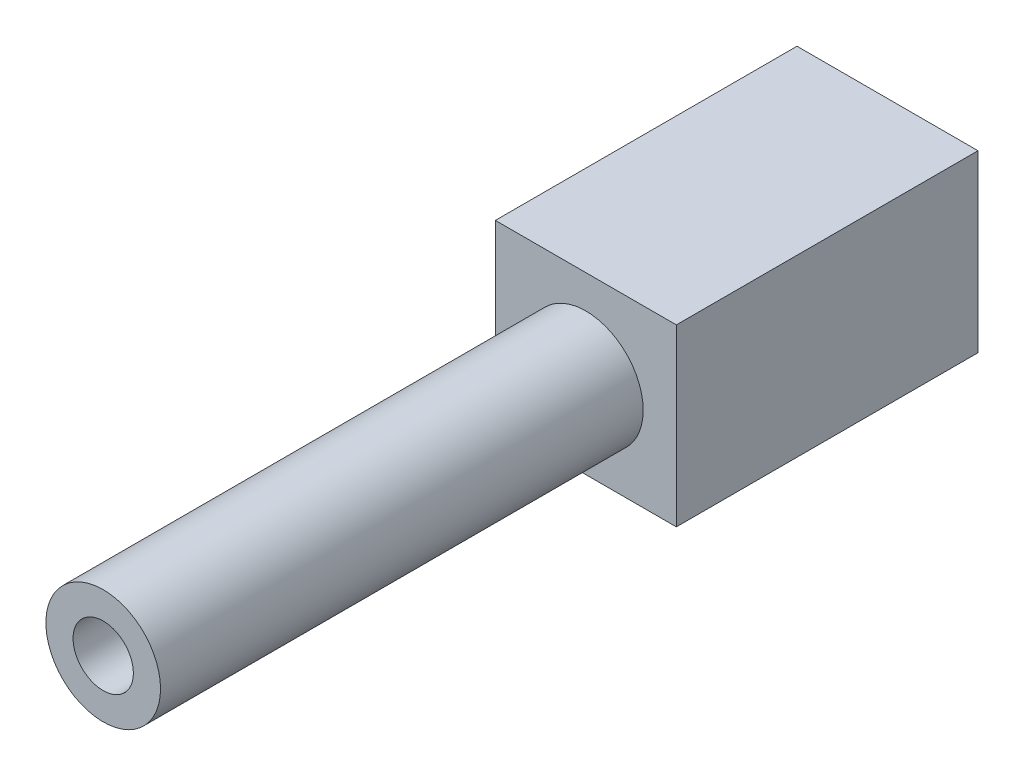
ISO-10303-21;
HEADER;
FILE_DESCRIPTION(('STEP AP214'),'2;1');
FILE_NAME('part.step','',(''),(''),'','','');
FILE_SCHEMA(('AUTOMOTIVE_DESIGN { 1 0 10303 214 1 1 1 1 }'));
ENDSEC;
DATA;
#1=APPLICATION_CONTEXT('core data for automotive mechanical design processes');
#2=APPLICATION_PROTOCOL_DEFINITION('international standard','automotive_design',2000,#1);
#3=PRODUCT_CONTEXT('',#1,'mechanical');
#4=PRODUCT('Part','Part','',(#3));
#5=PRODUCT_RELATED_PRODUCT_CATEGORY('part','',(#4));
#6=PRODUCT_DEFINITION_FORMATION('','',#4);
#7=PRODUCT_DEFINITION_CONTEXT('part definition',#1,'design');
#8=PRODUCT_DEFINITION('design','',#6,#7);
#9=PRODUCT_DEFINITION_SHAPE('','',#8);
#10=(LENGTH_UNIT() NAMED_UNIT(*) SI_UNIT(.MILLI.,.METRE.));
#11=(NAMED_UNIT(*) PLANE_ANGLE_UNIT() SI_UNIT($,.RADIAN.));
#12=(NAMED_UNIT(*) SI_UNIT($,.STERADIAN.) SOLID_ANGLE_UNIT());
#13=UNCERTAINTY_MEASURE_WITH_UNIT(LENGTH_MEASURE(1.E-05),#10,'distance_accuracy_value','');
#14=(GEOMETRIC_REPRESENTATION_CONTEXT(3) GLOBAL_UNCERTAINTY_ASSIGNED_CONTEXT((#13)) GLOBAL_UNIT_ASSIGNED_CONTEXT((#10,
#11,#12)) REPRESENTATION_CONTEXT('',''));
#15=CARTESIAN_POINT('',(0.,0.,0.));
#16=DIRECTION('',(0.,0.,1.));
#17=DIRECTION('',(1.,0.,0.));
#18=AXIS2_PLACEMENT_3D('',#15,#16,#17);
#19=CARTESIAN_POINT('',(0.,0.,16.));
#20=DIRECTION('',(0.,0.,1.));
#21=DIRECTION('',(1.,0.,0.));
#22=AXIS2_PLACEMENT_3D('',#19,#20,#21);
#23=PLANE('',#22);
#24=CARTESIAN_POINT('',(0.,0.,16.));
#25=DIRECTION('',(0.,0.,1.));
#26=DIRECTION('',(1.,0.,0.));
#27=AXIS2_PLACEMENT_3D('',#24,#25,#26);
#28=CIRCLE('',#27,1.9);
#29=CARTESIAN_POINT('',(1.9,0.,16.));
#30=VERTEX_POINT('',#29);
#31=EDGE_CURVE('E11',#30,#30,#28,.T.);
#32=ORIENTED_EDGE('',*,*,#31,.T.);
#33=EDGE_LOOP('',(#32));
#34=FACE_BOUND('',#33,.T.);
#35=CARTESIAN_POINT('',(0.,0.,16.));
#36=DIRECTION('',(0.,0.,1.));
#37=DIRECTION('',(1.,0.,0.));
#38=AXIS2_PLACEMENT_3D('',#35,#36,#37);
#39=CIRCLE('',#38,1.);
#40=CARTESIAN_POINT('',(1.,0.,16.));
#41=VERTEX_POINT('',#40);
#42=EDGE_CURVE('E43',#41,#41,#39,.T.);
#43=ORIENTED_EDGE('',*,*,#42,.F.);
#44=EDGE_LOOP('',(#43));
#45=FACE_BOUND('',#44,.T.);
#46=ADVANCED_FACE('F33',(#34,#45),#23,.T.);
#47=CARTESIAN_POINT('',(0.,0.,16.));
#48=DIRECTION('',(0.,0.,-1.));
#49=DIRECTION('',(-1.,0.,0.));
#50=AXIS2_PLACEMENT_3D('',#47,#48,#49);
#51=CYLINDRICAL_SURFACE('',#50,1.9);
#52=ORIENTED_EDGE('',*,*,#31,.F.);
#53=EDGE_LOOP('',(#52));
#54=FACE_BOUND('',#53,.T.);
#55=CARTESIAN_POINT('',(0.,0.,0.));
#56=DIRECTION('',(0.,0.,1.));
#57=DIRECTION('',(1.,0.,0.));
#58=AXIS2_PLACEMENT_3D('',#55,#56,#57);
#59=CIRCLE('',#58,1.9);
#60=CARTESIAN_POINT('',(1.9,0.,0.));
#61=VERTEX_POINT('',#60);
#62=EDGE_CURVE('E37',#61,#61,#59,.T.);
#63=ORIENTED_EDGE('',*,*,#62,.T.);
#64=EDGE_LOOP('',(#63));
#65=FACE_BOUND('',#64,.T.);
#66=ADVANCED_FACE('F35',(#54,#65),#51,.T.);
#67=CARTESIAN_POINT('',(0.,0.,16.));
#68=DIRECTION('',(0.,0.,-1.));
#69=DIRECTION('',(-1.,0.,0.));
#70=AXIS2_PLACEMENT_3D('',#67,#68,#69);
#71=CYLINDRICAL_SURFACE('',#70,1.);
#72=ORIENTED_EDGE('',*,*,#42,.T.);
#73=EDGE_LOOP('',(#72));
#74=FACE_BOUND('',#73,.T.);
#75=CARTESIAN_POINT('',(0.,0.,0.));
#76=DIRECTION('',(0.,0.,1.));
#77=DIRECTION('',(1.,0.,0.));
#78=AXIS2_PLACEMENT_3D('',#75,#76,#77);
#79=CIRCLE('',#78,1.);
#80=CARTESIAN_POINT('',(1.,0.,0.));
#81=VERTEX_POINT('',#80);
#82=EDGE_CURVE('E115',#81,#81,#79,.T.);
#83=ORIENTED_EDGE('',*,*,#82,.F.);
#84=EDGE_LOOP('',(#83));
#85=FACE_BOUND('',#84,.T.);
#86=ADVANCED_FACE('F143',(#74,#85),#71,.F.);
#87=CARTESIAN_POINT('',(0.,0.,0.));
#88=DIRECTION('',(0.,0.,1.));
#89=DIRECTION('',(1.,0.,0.));
#90=AXIS2_PLACEMENT_3D('',#87,#88,#89);
#91=PLANE('',#90);
#92=ORIENTED_EDGE('',*,*,#82,.T.);
#93=EDGE_LOOP('',(#92));
#94=FACE_BOUND('',#93,.T.);
#95=ADVANCED_FACE('F127',(#94),#91,.T.);
#96=CARTESIAN_POINT('',(-3.,3.,-10.));
#97=DIRECTION('',(-1.,0.,0.));
#98=DIRECTION('',(0.,-1.,0.));
#99=AXIS2_PLACEMENT_3D('',#96,#97,#98);
#100=PLANE('',#99);
#101=DIRECTION('',(0.,-1.,0.));
#102=VECTOR('',#101,1.);
#103=CARTESIAN_POINT('',(-3.,3.,0.));
#104=LINE('',#103,#102);
#105=CARTESIAN_POINT('',(-3.,3.,0.));
#106=VERTEX_POINT('',#105);
#107=CARTESIAN_POINT('',(-3.,-2.8,0.));
#108=VERTEX_POINT('',#107);
#109=EDGE_CURVE('E102',#106,#108,#104,.T.);
#110=ORIENTED_EDGE('',*,*,#109,.F.);
#111=DIRECTION('',(0.,0.,1.));
#112=VECTOR('',#111,1.);
#113=CARTESIAN_POINT('',(-3.,3.,-10.));
#114=LINE('',#113,#112);
#115=CARTESIAN_POINT('',(-3.,3.,-10.));
#116=VERTEX_POINT('',#115);
#117=EDGE_CURVE('E51',#116,#106,#114,.T.);
#118=ORIENTED_EDGE('',*,*,#117,.F.);
#119=DIRECTION('',(0.,-1.,0.));
#120=VECTOR('',#119,1.);
#121=CARTESIAN_POINT('',(-3.,3.,-10.));
#122=LINE('',#121,#120);
#123=CARTESIAN_POINT('',(-3.,-2.8,-10.));
#124=VERTEX_POINT('',#123);
#125=EDGE_CURVE('E96',#116,#124,#122,.T.);
#126=ORIENTED_EDGE('',*,*,#125,.T.);
#127=DIRECTION('',(0.,0.,1.));
#128=VECTOR('',#127,1.);
#129=CARTESIAN_POINT('',(-3.,-2.8,-10.));
#130=LINE('',#129,#128);
#131=EDGE_CURVE('E79',#124,#108,#130,.T.);
#132=ORIENTED_EDGE('',*,*,#131,.T.);
#133=EDGE_LOOP('',(#110,#118,#126,#132));
#134=FACE_BOUND('',#133,.T.);
#135=ADVANCED_FACE('F128',(#134),#100,.T.);
#136=CARTESIAN_POINT('',(-3.,3.,-10.));
#137=DIRECTION('',(0.,1.,0.));
#138=DIRECTION('',(0.,0.,1.));
#139=AXIS2_PLACEMENT_3D('',#136,#137,#138);
#140=PLANE('',#139);
#141=DIRECTION('',(-1.,0.,0.));
#142=VECTOR('',#141,1.);
#143=CARTESIAN_POINT('',(-3.,3.,0.));
#144=LINE('',#143,#142);
#145=CARTESIAN_POINT('',(3.,3.,0.));
#146=VERTEX_POINT('',#145);
#147=EDGE_CURVE('E98',#146,#106,#144,.T.);
#148=ORIENTED_EDGE('',*,*,#147,.F.);
#149=DIRECTION('',(0.,0.,1.));
#150=VECTOR('',#149,1.);
#151=CARTESIAN_POINT('',(3.,3.,-10.));
#152=LINE('',#151,#150);
#153=CARTESIAN_POINT('',(3.,3.,-10.));
#154=VERTEX_POINT('',#153);
#155=EDGE_CURVE('E68',#154,#146,#152,.T.);
#156=ORIENTED_EDGE('',*,*,#155,.F.);
#157=DIRECTION('',(-1.,0.,0.));
#158=VECTOR('',#157,1.);
#159=CARTESIAN_POINT('',(-3.,3.,-10.));
#160=LINE('',#159,#158);
#161=EDGE_CURVE('E93',#154,#116,#160,.T.);
#162=ORIENTED_EDGE('',*,*,#161,.T.);
#163=ORIENTED_EDGE('',*,*,#117,.T.);
#164=EDGE_LOOP('',(#148,#156,#162,#163));
#165=FACE_BOUND('',#164,.T.);
#166=ADVANCED_FACE('F129',(#165),#140,.T.);
#167=CARTESIAN_POINT('',(3.,3.,-10.));
#168=DIRECTION('',(1.,0.,0.));
#169=DIRECTION('',(0.,1.,0.));
#170=AXIS2_PLACEMENT_3D('',#167,#168,#169);
#171=PLANE('',#170);
#172=DIRECTION('',(0.,1.,0.));
#173=VECTOR('',#172,1.);
#174=CARTESIAN_POINT('',(3.,3.,0.));
#175=LINE('',#174,#173);
#176=CARTESIAN_POINT('',(3.,-2.8,0.));
#177=VERTEX_POINT('',#176);
#178=EDGE_CURVE('E87',#177,#146,#175,.T.);
#179=ORIENTED_EDGE('',*,*,#178,.F.);
#180=DIRECTION('',(0.,0.,1.));
#181=VECTOR('',#180,1.);
#182=CARTESIAN_POINT('',(3.,-2.8,-10.));
#183=LINE('',#182,#181);
#184=CARTESIAN_POINT('',(3.,-2.8,-10.));
#185=VERTEX_POINT('',#184);
#186=EDGE_CURVE('E82',#185,#177,#183,.T.);
#187=ORIENTED_EDGE('',*,*,#186,.F.);
#188=DIRECTION('',(0.,1.,0.));
#189=VECTOR('',#188,1.);
#190=CARTESIAN_POINT('',(3.,3.,-10.));
#191=LINE('',#190,#189);
#192=EDGE_CURVE('E85',#185,#154,#191,.T.);
#193=ORIENTED_EDGE('',*,*,#192,.T.);
#194=ORIENTED_EDGE('',*,*,#155,.T.);
#195=EDGE_LOOP('',(#179,#187,#193,#194));
#196=FACE_BOUND('',#195,.T.);
#197=ADVANCED_FACE('F84',(#196),#171,.T.);
#198=CARTESIAN_POINT('',(-3.,-2.8,-10.));
#199=DIRECTION('',(0.,-1.,0.));
#200=DIRECTION('',(0.,0.,-1.));
#201=AXIS2_PLACEMENT_3D('',#198,#199,#200);
#202=PLANE('',#201);
#203=DIRECTION('',(1.,0.,0.));
#204=VECTOR('',#203,1.);
#205=CARTESIAN_POINT('',(-3.,-2.8,0.));
#206=LINE('',#205,#204);
#207=EDGE_CURVE('E105',#108,#177,#206,.T.);
#208=ORIENTED_EDGE('',*,*,#207,.F.);
#209=ORIENTED_EDGE('',*,*,#131,.F.);
#210=DIRECTION('',(1.,0.,0.));
#211=VECTOR('',#210,1.);
#212=CARTESIAN_POINT('',(-3.,-2.8,-10.));
#213=LINE('',#212,#211);
#214=EDGE_CURVE('E92',#124,#185,#213,.T.);
#215=ORIENTED_EDGE('',*,*,#214,.T.);
#216=ORIENTED_EDGE('',*,*,#186,.T.);
#217=EDGE_LOOP('',(#208,#209,#215,#216));
#218=FACE_BOUND('',#217,.T.);
#219=ADVANCED_FACE('F95',(#218),#202,.T.);
#220=CARTESIAN_POINT('',(0.,0.,-10.));
#221=DIRECTION('',(0.,0.,1.));
#222=DIRECTION('',(1.,0.,0.));
#223=AXIS2_PLACEMENT_3D('',#220,#221,#222);
#224=PLANE('',#223);
#225=ORIENTED_EDGE('',*,*,#125,.F.);
#226=ORIENTED_EDGE('',*,*,#161,.F.);
#227=ORIENTED_EDGE('',*,*,#192,.F.);
#228=ORIENTED_EDGE('',*,*,#214,.F.);
#229=EDGE_LOOP('',(#225,#226,#227,#228));
#230=FACE_BOUND('',#229,.T.);
#231=ADVANCED_FACE('F91',(#230),#224,.F.);
#232=ORIENTED_EDGE('',*,*,#62,.F.);
#233=EDGE_LOOP('',(#232));
#234=FACE_BOUND('',#233,.T.);
#235=ORIENTED_EDGE('',*,*,#109,.T.);
#236=ORIENTED_EDGE('',*,*,#207,.T.);
#237=ORIENTED_EDGE('',*,*,#178,.T.);
#238=ORIENTED_EDGE('',*,*,#147,.T.);
#239=EDGE_LOOP('',(#235,#236,#237,#238));
#240=FACE_BOUND('',#239,.T.);
#241=ADVANCED_FACE('F123',(#234,#240),#91,.T.);
#242=CLOSED_SHELL('',(#46,#66,#86,#95,#135,#166,#197,#219,#231,#241));
#243=MANIFOLD_SOLID_BREP('B2',#242);
#244=ADVANCED_BREP_SHAPE_REPRESENTATION('',(#18,#243),#14);
#245=SHAPE_DEFINITION_REPRESENTATION(#9,#244);
ENDSEC;
END-ISO-10303-21;
